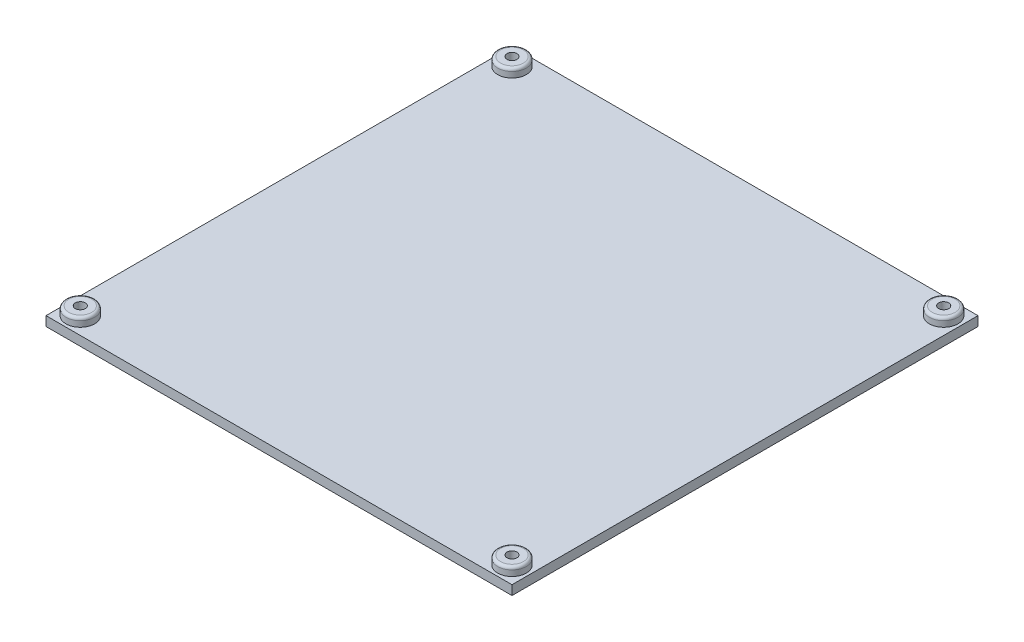
ISO-10303-21;
HEADER;
FILE_DESCRIPTION(('STEP AP214'),'2;1');
FILE_NAME('part.step','',(''),(''),'','','');
FILE_SCHEMA(('AUTOMOTIVE_DESIGN { 1 0 10303 214 1 1 1 1 }'));
ENDSEC;
DATA;
#1=APPLICATION_CONTEXT('core data for automotive mechanical design processes');
#2=APPLICATION_PROTOCOL_DEFINITION('international standard','automotive_design',2000,#1);
#3=PRODUCT_CONTEXT('',#1,'mechanical');
#4=PRODUCT('Part','Part','',(#3));
#5=PRODUCT_RELATED_PRODUCT_CATEGORY('part','',(#4));
#6=PRODUCT_DEFINITION_FORMATION('','',#4);
#7=PRODUCT_DEFINITION_CONTEXT('part definition',#1,'design');
#8=PRODUCT_DEFINITION('design','',#6,#7);
#9=PRODUCT_DEFINITION_SHAPE('','',#8);
#10=(LENGTH_UNIT() NAMED_UNIT(*) SI_UNIT(.MILLI.,.METRE.));
#11=(NAMED_UNIT(*) PLANE_ANGLE_UNIT() SI_UNIT($,.RADIAN.));
#12=(NAMED_UNIT(*) SI_UNIT($,.STERADIAN.) SOLID_ANGLE_UNIT());
#13=UNCERTAINTY_MEASURE_WITH_UNIT(LENGTH_MEASURE(1.E-05),#10,'distance_accuracy_value','');
#14=(GEOMETRIC_REPRESENTATION_CONTEXT(3) GLOBAL_UNCERTAINTY_ASSIGNED_CONTEXT((#13)) GLOBAL_UNIT_ASSIGNED_CONTEXT((#10,
#11,#12)) REPRESENTATION_CONTEXT('',''));
#15=CARTESIAN_POINT('',(0.,0.,0.));
#16=DIRECTION('',(0.,0.,1.));
#17=DIRECTION('',(1.,0.,0.));
#18=AXIS2_PLACEMENT_3D('',#15,#16,#17);
#19=CARTESIAN_POINT('',(81.5,-3.3,-81.5));
#20=DIRECTION('',(1.,0.,0.));
#21=DIRECTION('',(0.,0.,-1.));
#22=AXIS2_PLACEMENT_3D('',#19,#20,#21);
#23=PLANE('',#22);
#24=DIRECTION('',(0.,0.,-1.));
#25=VECTOR('',#24,1.);
#26=CARTESIAN_POINT('',(81.5,0.,-81.5));
#27=LINE('',#26,#25);
#28=CARTESIAN_POINT('',(81.5,0.,81.5));
#29=VERTEX_POINT('',#28);
#30=CARTESIAN_POINT('',(81.5,0.,-81.5));
#31=VERTEX_POINT('',#30);
#32=EDGE_CURVE('E110',#29,#31,#27,.T.);
#33=ORIENTED_EDGE('',*,*,#32,.F.);
#34=DIRECTION('',(0.,1.,0.));
#35=VECTOR('',#34,1.);
#36=CARTESIAN_POINT('',(81.5,-3.3,81.5));
#37=LINE('',#36,#35);
#38=CARTESIAN_POINT('',(81.5,-3.3,81.5));
#39=VERTEX_POINT('',#38);
#40=EDGE_CURVE('E58',#39,#29,#37,.T.);
#41=ORIENTED_EDGE('',*,*,#40,.F.);
#42=DIRECTION('',(0.,0.,-1.));
#43=VECTOR('',#42,1.);
#44=CARTESIAN_POINT('',(81.5,-3.3,-81.5));
#45=LINE('',#44,#43);
#46=CARTESIAN_POINT('',(81.5,-3.3,-81.5));
#47=VERTEX_POINT('',#46);
#48=EDGE_CURVE('E103',#39,#47,#45,.T.);
#49=ORIENTED_EDGE('',*,*,#48,.T.);
#50=DIRECTION('',(0.,1.,0.));
#51=VECTOR('',#50,1.);
#52=CARTESIAN_POINT('',(81.5,-3.3,-81.5));
#53=LINE('',#52,#51);
#54=EDGE_CURVE('E86',#47,#31,#53,.T.);
#55=ORIENTED_EDGE('',*,*,#54,.T.);
#56=EDGE_LOOP('',(#33,#41,#49,#55));
#57=FACE_BOUND('',#56,.T.);
#58=ADVANCED_FACE('F39',(#57),#23,.T.);
#59=CARTESIAN_POINT('',(-81.5,-3.3,81.5));
#60=DIRECTION('',(0.,0.,1.));
#61=DIRECTION('',(1.,0.,0.));
#62=AXIS2_PLACEMENT_3D('',#59,#60,#61);
#63=PLANE('',#62);
#64=DIRECTION('',(1.,0.,0.));
#65=VECTOR('',#64,1.);
#66=CARTESIAN_POINT('',(-81.5,0.,81.5));
#67=LINE('',#66,#65);
#68=CARTESIAN_POINT('',(-81.5,0.,81.5));
#69=VERTEX_POINT('',#68);
#70=EDGE_CURVE('E105',#69,#29,#67,.T.);
#71=ORIENTED_EDGE('',*,*,#70,.F.);
#72=DIRECTION('',(0.,1.,0.));
#73=VECTOR('',#72,1.);
#74=CARTESIAN_POINT('',(-81.5,-3.3,81.5));
#75=LINE('',#74,#73);
#76=CARTESIAN_POINT('',(-81.5,-3.3,81.5));
#77=VERTEX_POINT('',#76);
#78=EDGE_CURVE('E75',#77,#69,#75,.T.);
#79=ORIENTED_EDGE('',*,*,#78,.F.);
#80=DIRECTION('',(1.,0.,0.));
#81=VECTOR('',#80,1.);
#82=CARTESIAN_POINT('',(-81.5,-3.3,81.5));
#83=LINE('',#82,#81);
#84=EDGE_CURVE('E100',#77,#39,#83,.T.);
#85=ORIENTED_EDGE('',*,*,#84,.T.);
#86=ORIENTED_EDGE('',*,*,#40,.T.);
#87=EDGE_LOOP('',(#71,#79,#85,#86));
#88=FACE_BOUND('',#87,.T.);
#89=ADVANCED_FACE('F201',(#88),#63,.T.);
#90=CARTESIAN_POINT('',(-81.5,-3.3,-81.5));
#91=DIRECTION('',(-1.,0.,0.));
#92=DIRECTION('',(0.,0.,1.));
#93=AXIS2_PLACEMENT_3D('',#90,#91,#92);
#94=PLANE('',#93);
#95=DIRECTION('',(0.,0.,1.));
#96=VECTOR('',#95,1.);
#97=CARTESIAN_POINT('',(-81.5,0.,-81.5));
#98=LINE('',#97,#96);
#99=CARTESIAN_POINT('',(-81.5,0.,-81.5));
#100=VERTEX_POINT('',#99);
#101=EDGE_CURVE('E94',#100,#69,#98,.T.);
#102=ORIENTED_EDGE('',*,*,#101,.F.);
#103=DIRECTION('',(0.,1.,0.));
#104=VECTOR('',#103,1.);
#105=CARTESIAN_POINT('',(-81.5,-3.3,-81.5));
#106=LINE('',#105,#104);
#107=CARTESIAN_POINT('',(-81.5,-3.3,-81.5));
#108=VERTEX_POINT('',#107);
#109=EDGE_CURVE('E89',#108,#100,#106,.T.);
#110=ORIENTED_EDGE('',*,*,#109,.F.);
#111=DIRECTION('',(0.,0.,1.));
#112=VECTOR('',#111,1.);
#113=CARTESIAN_POINT('',(-81.5,-3.3,-81.5));
#114=LINE('',#113,#112);
#115=EDGE_CURVE('E92',#108,#77,#114,.T.);
#116=ORIENTED_EDGE('',*,*,#115,.T.);
#117=ORIENTED_EDGE('',*,*,#78,.T.);
#118=EDGE_LOOP('',(#102,#110,#116,#117));
#119=FACE_BOUND('',#118,.T.);
#120=ADVANCED_FACE('F91',(#119),#94,.T.);
#121=CARTESIAN_POINT('',(-81.5,-3.3,-81.5));
#122=DIRECTION('',(0.,0.,-1.));
#123=DIRECTION('',(-1.,0.,0.));
#124=AXIS2_PLACEMENT_3D('',#121,#122,#123);
#125=PLANE('',#124);
#126=DIRECTION('',(-1.,0.,0.));
#127=VECTOR('',#126,1.);
#128=CARTESIAN_POINT('',(-81.5,0.,-81.5));
#129=LINE('',#128,#127);
#130=EDGE_CURVE('E113',#31,#100,#129,.T.);
#131=ORIENTED_EDGE('',*,*,#130,.F.);
#132=ORIENTED_EDGE('',*,*,#54,.F.);
#133=DIRECTION('',(-1.,0.,0.));
#134=VECTOR('',#133,1.);
#135=CARTESIAN_POINT('',(-81.5,-3.3,-81.5));
#136=LINE('',#135,#134);
#137=EDGE_CURVE('E99',#47,#108,#136,.T.);
#138=ORIENTED_EDGE('',*,*,#137,.T.);
#139=ORIENTED_EDGE('',*,*,#109,.T.);
#140=EDGE_LOOP('',(#131,#132,#138,#139));
#141=FACE_BOUND('',#140,.T.);
#142=ADVANCED_FACE('F102',(#141),#125,.T.);
#143=CARTESIAN_POINT('',(0.,-3.3,0.));
#144=DIRECTION('',(0.,1.,0.));
#145=DIRECTION('',(0.,0.,1.));
#146=AXIS2_PLACEMENT_3D('',#143,#144,#145);
#147=PLANE('',#146);
#148=CARTESIAN_POINT('',(75.5,-3.3,75.5));
#149=DIRECTION('',(0.,-1.,0.));
#150=DIRECTION('',(0.,0.,-1.));
#151=AXIS2_PLACEMENT_3D('',#148,#149,#150);
#152=CIRCLE('',#151,3.25000000000001);
#153=CARTESIAN_POINT('',(75.5,-3.3,72.25));
#154=VERTEX_POINT('',#153);
#155=EDGE_CURVE('E166',#154,#154,#152,.T.);
#156=ORIENTED_EDGE('',*,*,#155,.F.);
#157=EDGE_LOOP('',(#156));
#158=FACE_BOUND('',#157,.T.);
#159=CARTESIAN_POINT('',(-75.5,-3.3,-75.5));
#160=DIRECTION('',(0.,-1.,0.));
#161=DIRECTION('',(0.,0.,-1.));
#162=AXIS2_PLACEMENT_3D('',#159,#160,#161);
#163=CIRCLE('',#162,3.25000000000001);
#164=CARTESIAN_POINT('',(-75.5,-3.3,-78.75));
#165=VERTEX_POINT('',#164);
#166=EDGE_CURVE('E173',#165,#165,#163,.T.);
#167=ORIENTED_EDGE('',*,*,#166,.F.);
#168=EDGE_LOOP('',(#167));
#169=FACE_BOUND('',#168,.T.);
#170=CARTESIAN_POINT('',(75.5,-3.3,-75.5));
#171=DIRECTION('',(0.,-1.,0.));
#172=DIRECTION('',(0.,0.,-1.));
#173=AXIS2_PLACEMENT_3D('',#170,#171,#172);
#174=CIRCLE('',#173,3.25000000000001);
#175=CARTESIAN_POINT('',(75.5,-3.3,-78.75));
#176=VERTEX_POINT('',#175);
#177=EDGE_CURVE('E157',#176,#176,#174,.T.);
#178=ORIENTED_EDGE('',*,*,#177,.F.);
#179=EDGE_LOOP('',(#178));
#180=FACE_BOUND('',#179,.T.);
#181=CARTESIAN_POINT('',(-75.5,-3.3,75.5));
#182=DIRECTION('',(0.,-1.,0.));
#183=DIRECTION('',(0.,0.,-1.));
#184=AXIS2_PLACEMENT_3D('',#181,#182,#183);
#185=CIRCLE('',#184,3.25000000000001);
#186=CARTESIAN_POINT('',(-75.5,-3.3,72.25));
#187=VERTEX_POINT('',#186);
#188=EDGE_CURVE('E169',#187,#187,#185,.T.);
#189=ORIENTED_EDGE('',*,*,#188,.F.);
#190=EDGE_LOOP('',(#189));
#191=FACE_BOUND('',#190,.T.);
#192=ORIENTED_EDGE('',*,*,#48,.F.);
#193=ORIENTED_EDGE('',*,*,#84,.F.);
#194=ORIENTED_EDGE('',*,*,#115,.F.);
#195=ORIENTED_EDGE('',*,*,#137,.F.);
#196=EDGE_LOOP('',(#192,#193,#194,#195));
#197=FACE_BOUND('',#196,.T.);
#198=ADVANCED_FACE('F98',(#158,#169,#180,#191,#197),#147,.F.);
#199=CARTESIAN_POINT('',(0.,0.,0.));
#200=DIRECTION('',(0.,1.,0.));
#201=DIRECTION('',(0.,0.,1.));
#202=AXIS2_PLACEMENT_3D('',#199,#200,#201);
#203=PLANE('',#202);
#204=CARTESIAN_POINT('',(75.5,0.,-75.5));
#205=DIRECTION('',(0.,1.,0.));
#206=DIRECTION('',(0.,0.,1.));
#207=AXIS2_PLACEMENT_3D('',#204,#205,#206);
#208=CIRCLE('',#207,5.00000000000001);
#209=CARTESIAN_POINT('',(75.5,0.,-70.5));
#210=VERTEX_POINT('',#209);
#211=EDGE_CURVE('E187',#210,#210,#208,.T.);
#212=ORIENTED_EDGE('',*,*,#211,.F.);
#213=EDGE_LOOP('',(#212));
#214=FACE_BOUND('',#213,.T.);
#215=CARTESIAN_POINT('',(-75.5,0.,75.5));
#216=DIRECTION('',(0.,1.,0.));
#217=DIRECTION('',(0.,0.,1.));
#218=AXIS2_PLACEMENT_3D('',#215,#216,#217);
#219=CIRCLE('',#218,5.00000000000001);
#220=CARTESIAN_POINT('',(-75.5,0.,80.5));
#221=VERTEX_POINT('',#220);
#222=EDGE_CURVE('E186',#221,#221,#219,.T.);
#223=ORIENTED_EDGE('',*,*,#222,.F.);
#224=EDGE_LOOP('',(#223));
#225=FACE_BOUND('',#224,.T.);
#226=CARTESIAN_POINT('',(75.5,0.,75.5));
#227=DIRECTION('',(0.,1.,0.));
#228=DIRECTION('',(0.,0.,1.));
#229=AXIS2_PLACEMENT_3D('',#226,#227,#228);
#230=CIRCLE('',#229,5.00000000000001);
#231=CARTESIAN_POINT('',(75.5,0.,80.5));
#232=VERTEX_POINT('',#231);
#233=EDGE_CURVE('E181',#232,#232,#230,.T.);
#234=ORIENTED_EDGE('',*,*,#233,.F.);
#235=EDGE_LOOP('',(#234));
#236=FACE_BOUND('',#235,.T.);
#237=CARTESIAN_POINT('',(-75.5,0.,-75.5));
#238=DIRECTION('',(0.,1.,0.));
#239=DIRECTION('',(0.,0.,1.));
#240=AXIS2_PLACEMENT_3D('',#237,#238,#239);
#241=CIRCLE('',#240,5.00000000000001);
#242=CARTESIAN_POINT('',(-75.5,0.,-70.5));
#243=VERTEX_POINT('',#242);
#244=EDGE_CURVE('E114',#243,#243,#241,.T.);
#245=ORIENTED_EDGE('',*,*,#244,.F.);
#246=EDGE_LOOP('',(#245));
#247=FACE_BOUND('',#246,.T.);
#248=ORIENTED_EDGE('',*,*,#32,.T.);
#249=ORIENTED_EDGE('',*,*,#130,.T.);
#250=ORIENTED_EDGE('',*,*,#101,.T.);
#251=ORIENTED_EDGE('',*,*,#70,.T.);
#252=EDGE_LOOP('',(#248,#249,#250,#251));
#253=FACE_BOUND('',#252,.T.);
#254=ADVANCED_FACE('F196',(#214,#225,#236,#247,#253),#203,.T.);
#255=CARTESIAN_POINT('',(-75.5,3.,-75.5));
#256=DIRECTION('',(0.,-1.,0.));
#257=DIRECTION('',(0.,0.,-1.));
#258=AXIS2_PLACEMENT_3D('',#255,#256,#257);
#259=CYLINDRICAL_SURFACE('',#258,5.00000000000001);
#260=CARTESIAN_POINT('',(-75.5,2.,-75.5));
#261=DIRECTION('',(0.,1.,0.));
#262=DIRECTION('',(0.,0.,1.));
#263=AXIS2_PLACEMENT_3D('',#260,#261,#262);
#264=CIRCLE('',#263,5.00000000000001);
#265=CARTESIAN_POINT('',(-75.5,2.,-70.5));
#266=VERTEX_POINT('',#265);
#267=EDGE_CURVE('E11',#266,#266,#264,.F.);
#268=ORIENTED_EDGE('',*,*,#267,.T.);
#269=EDGE_LOOP('',(#268));
#270=FACE_BOUND('',#269,.T.);
#271=ORIENTED_EDGE('',*,*,#244,.T.);
#272=EDGE_LOOP('',(#271));
#273=FACE_BOUND('',#272,.T.);
#274=ADVANCED_FACE('F194',(#270,#273),#259,.T.);
#275=CARTESIAN_POINT('',(-75.5,3.,-75.5));
#276=DIRECTION('',(0.,1.,0.));
#277=DIRECTION('',(0.,0.,1.));
#278=AXIS2_PLACEMENT_3D('',#275,#276,#277);
#279=PLANE('',#278);
#280=CARTESIAN_POINT('',(-75.5,3.,-75.5));
#281=DIRECTION('',(0.,1.,0.));
#282=DIRECTION('',(0.,0.,1.));
#283=AXIS2_PLACEMENT_3D('',#280,#281,#282);
#284=CIRCLE('',#283,1.75);
#285=CARTESIAN_POINT('',(-75.5,3.,-73.75));
#286=VERTEX_POINT('',#285);
#287=EDGE_CURVE('E301',#286,#286,#284,.T.);
#288=ORIENTED_EDGE('',*,*,#287,.F.);
#289=EDGE_LOOP('',(#288));
#290=FACE_BOUND('',#289,.T.);
#291=CARTESIAN_POINT('',(-75.5,3.,-75.5));
#292=DIRECTION('',(0.,1.,0.));
#293=DIRECTION('',(0.,0.,1.));
#294=AXIS2_PLACEMENT_3D('',#291,#292,#293);
#295=CIRCLE('',#294,4.00000000000001);
#296=CARTESIAN_POINT('',(-75.5,3.,-71.5));
#297=VERTEX_POINT('',#296);
#298=EDGE_CURVE('E49',#297,#297,#295,.T.);
#299=ORIENTED_EDGE('',*,*,#298,.T.);
#300=EDGE_LOOP('',(#299));
#301=FACE_BOUND('',#300,.T.);
#302=ADVANCED_FACE('F254',(#290,#301),#279,.T.);
#303=CARTESIAN_POINT('',(75.5,3.,75.5));
#304=DIRECTION('',(0.,-1.,0.));
#305=DIRECTION('',(0.,0.,-1.));
#306=AXIS2_PLACEMENT_3D('',#303,#304,#305);
#307=CYLINDRICAL_SURFACE('',#306,5.00000000000001);
#308=CARTESIAN_POINT('',(75.5,2.,75.5));
#309=DIRECTION('',(0.,1.,0.));
#310=DIRECTION('',(0.,0.,1.));
#311=AXIS2_PLACEMENT_3D('',#308,#309,#310);
#312=CIRCLE('',#311,5.00000000000001);
#313=CARTESIAN_POINT('',(75.5,2.,80.5));
#314=VERTEX_POINT('',#313);
#315=EDGE_CURVE('E131',#314,#314,#312,.F.);
#316=ORIENTED_EDGE('',*,*,#315,.T.);
#317=EDGE_LOOP('',(#316));
#318=FACE_BOUND('',#317,.T.);
#319=ORIENTED_EDGE('',*,*,#233,.T.);
#320=EDGE_LOOP('',(#319));
#321=FACE_BOUND('',#320,.T.);
#322=ADVANCED_FACE('F257',(#318,#321),#307,.T.);
#323=CARTESIAN_POINT('',(75.5,3.,75.5));
#324=DIRECTION('',(0.,1.,0.));
#325=DIRECTION('',(0.,0.,1.));
#326=AXIS2_PLACEMENT_3D('',#323,#324,#325);
#327=PLANE('',#326);
#328=CARTESIAN_POINT('',(75.5,3.,75.5));
#329=DIRECTION('',(0.,1.,0.));
#330=DIRECTION('',(0.,0.,1.));
#331=AXIS2_PLACEMENT_3D('',#328,#329,#330);
#332=CIRCLE('',#331,1.75);
#333=CARTESIAN_POINT('',(75.5,3.,77.25));
#334=VERTEX_POINT('',#333);
#335=EDGE_CURVE('E146',#334,#334,#332,.T.);
#336=ORIENTED_EDGE('',*,*,#335,.F.);
#337=EDGE_LOOP('',(#336));
#338=FACE_BOUND('',#337,.T.);
#339=CARTESIAN_POINT('',(75.5,3.,75.5));
#340=DIRECTION('',(0.,1.,0.));
#341=DIRECTION('',(0.,0.,1.));
#342=AXIS2_PLACEMENT_3D('',#339,#340,#341);
#343=CIRCLE('',#342,4.00000000000001);
#344=CARTESIAN_POINT('',(75.5,3.,79.5));
#345=VERTEX_POINT('',#344);
#346=EDGE_CURVE('E128',#345,#345,#343,.T.);
#347=ORIENTED_EDGE('',*,*,#346,.T.);
#348=EDGE_LOOP('',(#347));
#349=FACE_BOUND('',#348,.T.);
#350=ADVANCED_FACE('F248',(#338,#349),#327,.T.);
#351=CARTESIAN_POINT('',(-75.5,3.,75.5));
#352=DIRECTION('',(0.,-1.,0.));
#353=DIRECTION('',(0.,0.,-1.));
#354=AXIS2_PLACEMENT_3D('',#351,#352,#353);
#355=CYLINDRICAL_SURFACE('',#354,5.00000000000001);
#356=CARTESIAN_POINT('',(-75.5,2.,75.5));
#357=DIRECTION('',(0.,1.,0.));
#358=DIRECTION('',(0.,0.,1.));
#359=AXIS2_PLACEMENT_3D('',#356,#357,#358);
#360=CIRCLE('',#359,5.00000000000001);
#361=CARTESIAN_POINT('',(-75.5,2.,80.5));
#362=VERTEX_POINT('',#361);
#363=EDGE_CURVE('E137',#362,#362,#360,.F.);
#364=ORIENTED_EDGE('',*,*,#363,.T.);
#365=EDGE_LOOP('',(#364));
#366=FACE_BOUND('',#365,.T.);
#367=ORIENTED_EDGE('',*,*,#222,.T.);
#368=EDGE_LOOP('',(#367));
#369=FACE_BOUND('',#368,.T.);
#370=ADVANCED_FACE('F237',(#366,#369),#355,.T.);
#371=CARTESIAN_POINT('',(-75.5,3.,75.5));
#372=DIRECTION('',(0.,1.,0.));
#373=DIRECTION('',(0.,0.,1.));
#374=AXIS2_PLACEMENT_3D('',#371,#372,#373);
#375=PLANE('',#374);
#376=CARTESIAN_POINT('',(-75.5,3.,75.5));
#377=DIRECTION('',(0.,1.,0.));
#378=DIRECTION('',(0.,0.,1.));
#379=AXIS2_PLACEMENT_3D('',#376,#377,#378);
#380=CIRCLE('',#379,1.75);
#381=CARTESIAN_POINT('',(-75.5,3.,77.25));
#382=VERTEX_POINT('',#381);
#383=EDGE_CURVE('E305',#382,#382,#380,.T.);
#384=ORIENTED_EDGE('',*,*,#383,.F.);
#385=EDGE_LOOP('',(#384));
#386=FACE_BOUND('',#385,.T.);
#387=CARTESIAN_POINT('',(-75.5,3.,75.5));
#388=DIRECTION('',(0.,1.,0.));
#389=DIRECTION('',(0.,0.,1.));
#390=AXIS2_PLACEMENT_3D('',#387,#388,#389);
#391=CIRCLE('',#390,4.00000000000001);
#392=CARTESIAN_POINT('',(-75.5,3.,79.5));
#393=VERTEX_POINT('',#392);
#394=EDGE_CURVE('E134',#393,#393,#391,.T.);
#395=ORIENTED_EDGE('',*,*,#394,.T.);
#396=EDGE_LOOP('',(#395));
#397=FACE_BOUND('',#396,.T.);
#398=ADVANCED_FACE('F234',(#386,#397),#375,.T.);
#399=CARTESIAN_POINT('',(75.5,3.,-75.5));
#400=DIRECTION('',(0.,-1.,0.));
#401=DIRECTION('',(0.,0.,-1.));
#402=AXIS2_PLACEMENT_3D('',#399,#400,#401);
#403=CYLINDRICAL_SURFACE('',#402,5.00000000000001);
#404=CARTESIAN_POINT('',(75.5,2.,-75.5));
#405=DIRECTION('',(0.,1.,0.));
#406=DIRECTION('',(0.,0.,1.));
#407=AXIS2_PLACEMENT_3D('',#404,#405,#406);
#408=CIRCLE('',#407,5.00000000000001);
#409=CARTESIAN_POINT('',(75.5,2.,-70.5));
#410=VERTEX_POINT('',#409);
#411=EDGE_CURVE('E125',#410,#410,#408,.F.);
#412=ORIENTED_EDGE('',*,*,#411,.T.);
#413=EDGE_LOOP('',(#412));
#414=FACE_BOUND('',#413,.T.);
#415=ORIENTED_EDGE('',*,*,#211,.T.);
#416=EDGE_LOOP('',(#415));
#417=FACE_BOUND('',#416,.T.);
#418=ADVANCED_FACE('F236',(#414,#417),#403,.T.);
#419=CARTESIAN_POINT('',(75.5,3.,-75.5));
#420=DIRECTION('',(0.,1.,0.));
#421=DIRECTION('',(0.,0.,1.));
#422=AXIS2_PLACEMENT_3D('',#419,#420,#421);
#423=PLANE('',#422);
#424=CARTESIAN_POINT('',(75.5,3.,-75.5));
#425=DIRECTION('',(0.,1.,0.));
#426=DIRECTION('',(0.,0.,1.));
#427=AXIS2_PLACEMENT_3D('',#424,#425,#426);
#428=CIRCLE('',#427,1.75);
#429=CARTESIAN_POINT('',(75.5,3.,-73.75));
#430=VERTEX_POINT('',#429);
#431=EDGE_CURVE('E297',#430,#430,#428,.T.);
#432=ORIENTED_EDGE('',*,*,#431,.F.);
#433=EDGE_LOOP('',(#432));
#434=FACE_BOUND('',#433,.T.);
#435=CARTESIAN_POINT('',(75.5,3.,-75.5));
#436=DIRECTION('',(0.,1.,0.));
#437=DIRECTION('',(0.,0.,1.));
#438=AXIS2_PLACEMENT_3D('',#435,#436,#437);
#439=CIRCLE('',#438,4.00000000000001);
#440=CARTESIAN_POINT('',(75.5,3.,-71.5));
#441=VERTEX_POINT('',#440);
#442=EDGE_CURVE('E120',#441,#441,#439,.T.);
#443=ORIENTED_EDGE('',*,*,#442,.T.);
#444=EDGE_LOOP('',(#443));
#445=FACE_BOUND('',#444,.T.);
#446=ADVANCED_FACE('F218',(#434,#445),#423,.T.);
#447=CARTESIAN_POINT('',(75.5,2.,-75.5));
#448=DIRECTION('',(0.,1.,0.));
#449=DIRECTION('',(0.,0.,1.));
#450=AXIS2_PLACEMENT_3D('',#447,#448,#449);
#451=TOROIDAL_SURFACE('',#450,4.00000000000001,1.);
#452=ORIENTED_EDGE('',*,*,#411,.F.);
#453=EDGE_LOOP('',(#452));
#454=FACE_BOUND('',#453,.T.);
#455=ORIENTED_EDGE('',*,*,#442,.F.);
#456=EDGE_LOOP('',(#455));
#457=FACE_BOUND('',#456,.T.);
#458=ADVANCED_FACE('F214',(#454,#457),#451,.T.);
#459=CARTESIAN_POINT('',(75.5,2.,75.5));
#460=DIRECTION('',(0.,1.,0.));
#461=DIRECTION('',(0.,0.,1.));
#462=AXIS2_PLACEMENT_3D('',#459,#460,#461);
#463=TOROIDAL_SURFACE('',#462,4.00000000000001,1.);
#464=ORIENTED_EDGE('',*,*,#315,.F.);
#465=EDGE_LOOP('',(#464));
#466=FACE_BOUND('',#465,.T.);
#467=ORIENTED_EDGE('',*,*,#346,.F.);
#468=EDGE_LOOP('',(#467));
#469=FACE_BOUND('',#468,.T.);
#470=ADVANCED_FACE('F217',(#466,#469),#463,.T.);
#471=CARTESIAN_POINT('',(-75.5,2.,75.5));
#472=DIRECTION('',(0.,1.,0.));
#473=DIRECTION('',(0.,0.,1.));
#474=AXIS2_PLACEMENT_3D('',#471,#472,#473);
#475=TOROIDAL_SURFACE('',#474,4.00000000000001,1.);
#476=ORIENTED_EDGE('',*,*,#363,.F.);
#477=EDGE_LOOP('',(#476));
#478=FACE_BOUND('',#477,.T.);
#479=ORIENTED_EDGE('',*,*,#394,.F.);
#480=EDGE_LOOP('',(#479));
#481=FACE_BOUND('',#480,.T.);
#482=ADVANCED_FACE('F221',(#478,#481),#475,.T.);
#483=CARTESIAN_POINT('',(-75.5,2.,-75.5));
#484=DIRECTION('',(0.,1.,0.));
#485=DIRECTION('',(0.,0.,1.));
#486=AXIS2_PLACEMENT_3D('',#483,#484,#485);
#487=TOROIDAL_SURFACE('',#486,4.00000000000001,1.);
#488=ORIENTED_EDGE('',*,*,#267,.F.);
#489=EDGE_LOOP('',(#488));
#490=FACE_BOUND('',#489,.T.);
#491=ORIENTED_EDGE('',*,*,#298,.F.);
#492=EDGE_LOOP('',(#491));
#493=FACE_BOUND('',#492,.T.);
#494=ADVANCED_FACE('F41',(#490,#493),#487,.T.);
#495=CARTESIAN_POINT('',(-75.5,-0.3,75.5));
#496=DIRECTION('',(0.,-1.,0.));
#497=DIRECTION('',(0.,0.,-1.));
#498=AXIS2_PLACEMENT_3D('',#495,#496,#497);
#499=CYLINDRICAL_SURFACE('',#498,3.25000000000001);
#500=CARTESIAN_POINT('',(-75.5,-0.3,75.5));
#501=DIRECTION('',(0.,-1.,0.));
#502=DIRECTION('',(0.,0.,-1.));
#503=AXIS2_PLACEMENT_3D('',#500,#501,#502);
#504=CIRCLE('',#503,3.25000000000001);
#505=CARTESIAN_POINT('',(-75.5,-0.3,72.25));
#506=VERTEX_POINT('',#505);
#507=EDGE_CURVE('E178',#506,#506,#504,.T.);
#508=ORIENTED_EDGE('',*,*,#507,.F.);
#509=EDGE_LOOP('',(#508));
#510=FACE_BOUND('',#509,.T.);
#511=ORIENTED_EDGE('',*,*,#188,.T.);
#512=EDGE_LOOP('',(#511));
#513=FACE_BOUND('',#512,.T.);
#514=ADVANCED_FACE('F228',(#510,#513),#499,.F.);
#515=CARTESIAN_POINT('',(-75.5,-0.3,75.5));
#516=DIRECTION('',(0.,-1.,0.));
#517=DIRECTION('',(0.,0.,-1.));
#518=AXIS2_PLACEMENT_3D('',#515,#516,#517);
#519=PLANE('',#518);
#520=CARTESIAN_POINT('',(-75.5,-0.3,75.5));
#521=DIRECTION('',(0.,-1.,0.));
#522=DIRECTION('',(0.,0.,-1.));
#523=AXIS2_PLACEMENT_3D('',#520,#521,#522);
#524=CIRCLE('',#523,1.75);
#525=CARTESIAN_POINT('',(-75.5,-0.3,73.75));
#526=VERTEX_POINT('',#525);
#527=EDGE_CURVE('E43',#526,#526,#524,.T.);
#528=ORIENTED_EDGE('',*,*,#527,.F.);
#529=EDGE_LOOP('',(#528));
#530=FACE_BOUND('',#529,.T.);
#531=ORIENTED_EDGE('',*,*,#507,.T.);
#532=EDGE_LOOP('',(#531));
#533=FACE_BOUND('',#532,.T.);
#534=ADVANCED_FACE('F274',(#530,#533),#519,.T.);
#535=CARTESIAN_POINT('',(75.5,-0.3,-75.5));
#536=DIRECTION('',(0.,-1.,0.));
#537=DIRECTION('',(0.,0.,-1.));
#538=AXIS2_PLACEMENT_3D('',#535,#536,#537);
#539=CYLINDRICAL_SURFACE('',#538,3.25000000000001);
#540=CARTESIAN_POINT('',(75.5,-0.3,-75.5));
#541=DIRECTION('',(0.,-1.,0.));
#542=DIRECTION('',(0.,0.,-1.));
#543=AXIS2_PLACEMENT_3D('',#540,#541,#542);
#544=CIRCLE('',#543,3.25000000000001);
#545=CARTESIAN_POINT('',(75.5,-0.3,-78.75));
#546=VERTEX_POINT('',#545);
#547=EDGE_CURVE('E153',#546,#546,#544,.T.);
#548=ORIENTED_EDGE('',*,*,#547,.F.);
#549=EDGE_LOOP('',(#548));
#550=FACE_BOUND('',#549,.T.);
#551=ORIENTED_EDGE('',*,*,#177,.T.);
#552=EDGE_LOOP('',(#551));
#553=FACE_BOUND('',#552,.T.);
#554=ADVANCED_FACE('F281',(#550,#553),#539,.F.);
#555=CARTESIAN_POINT('',(75.5,-0.3,-75.5));
#556=DIRECTION('',(0.,-1.,0.));
#557=DIRECTION('',(0.,0.,-1.));
#558=AXIS2_PLACEMENT_3D('',#555,#556,#557);
#559=PLANE('',#558);
#560=CARTESIAN_POINT('',(75.5,-0.3,-75.5));
#561=DIRECTION('',(0.,-1.,0.));
#562=DIRECTION('',(0.,0.,-1.));
#563=AXIS2_PLACEMENT_3D('',#560,#561,#562);
#564=CIRCLE('',#563,1.75);
#565=CARTESIAN_POINT('',(75.5,-0.3,-77.25));
#566=VERTEX_POINT('',#565);
#567=EDGE_CURVE('E148',#566,#566,#564,.T.);
#568=ORIENTED_EDGE('',*,*,#567,.F.);
#569=EDGE_LOOP('',(#568));
#570=FACE_BOUND('',#569,.T.);
#571=ORIENTED_EDGE('',*,*,#547,.T.);
#572=EDGE_LOOP('',(#571));
#573=FACE_BOUND('',#572,.T.);
#574=ADVANCED_FACE('F327',(#570,#573),#559,.T.);
#575=CARTESIAN_POINT('',(-75.5,-0.3,-75.5));
#576=DIRECTION('',(0.,-1.,0.));
#577=DIRECTION('',(0.,0.,-1.));
#578=AXIS2_PLACEMENT_3D('',#575,#576,#577);
#579=CYLINDRICAL_SURFACE('',#578,3.25000000000001);
#580=CARTESIAN_POINT('',(-75.5,-0.3,-75.5));
#581=DIRECTION('',(0.,-1.,0.));
#582=DIRECTION('',(0.,0.,-1.));
#583=AXIS2_PLACEMENT_3D('',#580,#581,#582);
#584=CIRCLE('',#583,3.25000000000001);
#585=CARTESIAN_POINT('',(-75.5,-0.3,-78.75));
#586=VERTEX_POINT('',#585);
#587=EDGE_CURVE('E162',#586,#586,#584,.T.);
#588=ORIENTED_EDGE('',*,*,#587,.F.);
#589=EDGE_LOOP('',(#588));
#590=FACE_BOUND('',#589,.T.);
#591=ORIENTED_EDGE('',*,*,#166,.T.);
#592=EDGE_LOOP('',(#591));
#593=FACE_BOUND('',#592,.T.);
#594=ADVANCED_FACE('F331',(#590,#593),#579,.F.);
#595=CARTESIAN_POINT('',(-75.5,-0.3,-75.5));
#596=DIRECTION('',(0.,-1.,0.));
#597=DIRECTION('',(0.,0.,-1.));
#598=AXIS2_PLACEMENT_3D('',#595,#596,#597);
#599=PLANE('',#598);
#600=CARTESIAN_POINT('',(-75.5,-0.3,-75.5));
#601=DIRECTION('',(0.,-1.,0.));
#602=DIRECTION('',(0.,0.,-1.));
#603=AXIS2_PLACEMENT_3D('',#600,#601,#602);
#604=CIRCLE('',#603,1.75);
#605=CARTESIAN_POINT('',(-75.5,-0.3,-77.25));
#606=VERTEX_POINT('',#605);
#607=EDGE_CURVE('E145',#606,#606,#604,.T.);
#608=ORIENTED_EDGE('',*,*,#607,.F.);
#609=EDGE_LOOP('',(#608));
#610=FACE_BOUND('',#609,.T.);
#611=ORIENTED_EDGE('',*,*,#587,.T.);
#612=EDGE_LOOP('',(#611));
#613=FACE_BOUND('',#612,.T.);
#614=ADVANCED_FACE('F336',(#610,#613),#599,.T.);
#615=CARTESIAN_POINT('',(75.5,-0.3,75.5));
#616=DIRECTION('',(0.,-1.,0.));
#617=DIRECTION('',(0.,0.,-1.));
#618=AXIS2_PLACEMENT_3D('',#615,#616,#617);
#619=CYLINDRICAL_SURFACE('',#618,3.25000000000001);
#620=CARTESIAN_POINT('',(75.5,-0.3,75.5));
#621=DIRECTION('',(0.,-1.,0.));
#622=DIRECTION('',(0.,0.,-1.));
#623=AXIS2_PLACEMENT_3D('',#620,#621,#622);
#624=CIRCLE('',#623,3.25000000000001);
#625=CARTESIAN_POINT('',(75.5,-0.3,72.25));
#626=VERTEX_POINT('',#625);
#627=EDGE_CURVE('E170',#626,#626,#624,.T.);
#628=ORIENTED_EDGE('',*,*,#627,.F.);
#629=EDGE_LOOP('',(#628));
#630=FACE_BOUND('',#629,.T.);
#631=ORIENTED_EDGE('',*,*,#155,.T.);
#632=EDGE_LOOP('',(#631));
#633=FACE_BOUND('',#632,.T.);
#634=ADVANCED_FACE('F333',(#630,#633),#619,.F.);
#635=CARTESIAN_POINT('',(75.5,-0.3,75.5));
#636=DIRECTION('',(0.,-1.,0.));
#637=DIRECTION('',(0.,0.,-1.));
#638=AXIS2_PLACEMENT_3D('',#635,#636,#637);
#639=PLANE('',#638);
#640=CARTESIAN_POINT('',(75.5,-0.3,75.5));
#641=DIRECTION('',(0.,-1.,0.));
#642=DIRECTION('',(0.,0.,-1.));
#643=AXIS2_PLACEMENT_3D('',#640,#641,#642);
#644=CIRCLE('',#643,1.75);
#645=CARTESIAN_POINT('',(75.5,-0.3,73.75));
#646=VERTEX_POINT('',#645);
#647=EDGE_CURVE('E142',#646,#646,#644,.T.);
#648=ORIENTED_EDGE('',*,*,#647,.F.);
#649=EDGE_LOOP('',(#648));
#650=FACE_BOUND('',#649,.T.);
#651=ORIENTED_EDGE('',*,*,#627,.T.);
#652=EDGE_LOOP('',(#651));
#653=FACE_BOUND('',#652,.T.);
#654=ADVANCED_FACE('F324',(#650,#653),#639,.T.);
#655=CARTESIAN_POINT('',(75.5,-8.24974746830584,75.5));
#656=DIRECTION('',(0.,1.,0.));
#657=DIRECTION('',(0.,0.,1.));
#658=AXIS2_PLACEMENT_3D('',#655,#656,#657);
#659=CYLINDRICAL_SURFACE('',#658,1.75);
#660=ORIENTED_EDGE('',*,*,#647,.T.);
#661=EDGE_LOOP('',(#660));
#662=FACE_BOUND('',#661,.T.);
#663=ORIENTED_EDGE('',*,*,#335,.T.);
#664=EDGE_LOOP('',(#663));
#665=FACE_BOUND('',#664,.T.);
#666=ADVANCED_FACE('F321',(#662,#665),#659,.F.);
#667=CARTESIAN_POINT('',(-75.5,-8.24974746830584,-75.5));
#668=DIRECTION('',(0.,1.,0.));
#669=DIRECTION('',(0.,0.,1.));
#670=AXIS2_PLACEMENT_3D('',#667,#668,#669);
#671=CYLINDRICAL_SURFACE('',#670,1.75);
#672=ORIENTED_EDGE('',*,*,#607,.T.);
#673=EDGE_LOOP('',(#672));
#674=FACE_BOUND('',#673,.T.);
#675=ORIENTED_EDGE('',*,*,#287,.T.);
#676=EDGE_LOOP('',(#675));
#677=FACE_BOUND('',#676,.T.);
#678=ADVANCED_FACE('F317',(#674,#677),#671,.F.);
#679=CARTESIAN_POINT('',(75.5,-8.24974746830584,-75.5));
#680=DIRECTION('',(0.,1.,0.));
#681=DIRECTION('',(0.,0.,1.));
#682=AXIS2_PLACEMENT_3D('',#679,#680,#681);
#683=CYLINDRICAL_SURFACE('',#682,1.75);
#684=ORIENTED_EDGE('',*,*,#567,.T.);
#685=EDGE_LOOP('',(#684));
#686=FACE_BOUND('',#685,.T.);
#687=ORIENTED_EDGE('',*,*,#431,.T.);
#688=EDGE_LOOP('',(#687));
#689=FACE_BOUND('',#688,.T.);
#690=ADVANCED_FACE('F312',(#686,#689),#683,.F.);
#691=CARTESIAN_POINT('',(-75.5,-8.24974746830584,75.5));
#692=DIRECTION('',(0.,1.,0.));
#693=DIRECTION('',(0.,0.,1.));
#694=AXIS2_PLACEMENT_3D('',#691,#692,#693);
#695=CYLINDRICAL_SURFACE('',#694,1.75);
#696=ORIENTED_EDGE('',*,*,#527,.T.);
#697=EDGE_LOOP('',(#696));
#698=FACE_BOUND('',#697,.T.);
#699=ORIENTED_EDGE('',*,*,#383,.T.);
#700=EDGE_LOOP('',(#699));
#701=FACE_BOUND('',#700,.T.);
#702=ADVANCED_FACE('F310',(#698,#701),#695,.F.);
#703=CLOSED_SHELL('',(#58,#89,#120,#142,#198,#254,#274,#302,#322,#350,#370,#398,#418,#446,#458,
#470,#482,#494,#514,#534,#554,#574,#594,#614,#634,#654,#666,#678,#690,#702));
#704=MANIFOLD_SOLID_BREP('B2',#703);
#705=ADVANCED_BREP_SHAPE_REPRESENTATION('',(#18,#704),#14);
#706=SHAPE_DEFINITION_REPRESENTATION(#9,#705);
ENDSEC;
END-ISO-10303-21;
